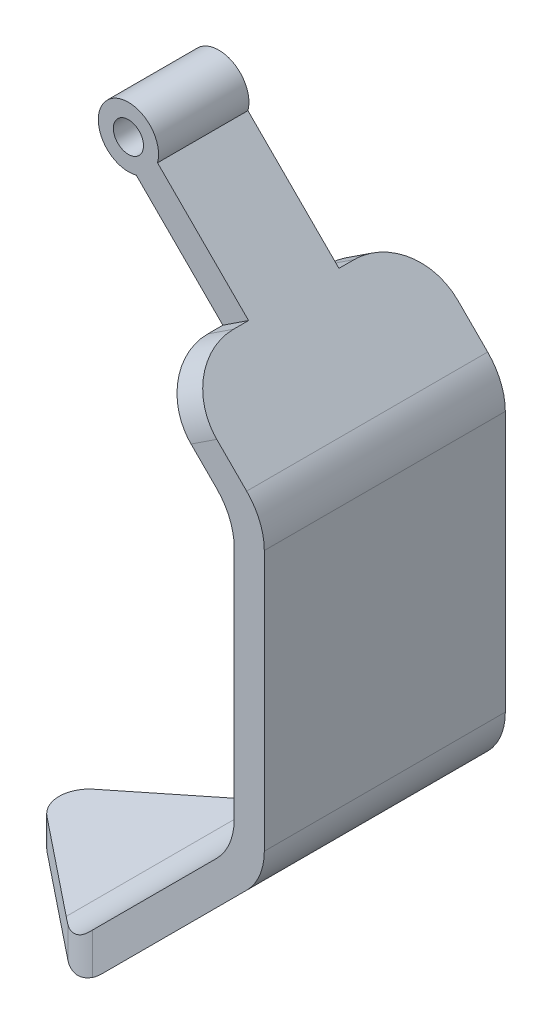
ISO-10303-21;
HEADER;
FILE_DESCRIPTION(('STEP AP214'),'2;1');
FILE_NAME('part.step','',(''),(''),'','','');
FILE_SCHEMA(('AUTOMOTIVE_DESIGN { 1 0 10303 214 1 1 1 1 }'));
ENDSEC;
DATA;
#1=APPLICATION_CONTEXT('core data for automotive mechanical design processes');
#2=APPLICATION_PROTOCOL_DEFINITION('international standard','automotive_design',2000,#1);
#3=PRODUCT_CONTEXT('',#1,'mechanical');
#4=PRODUCT('Part','Part','',(#3));
#5=PRODUCT_RELATED_PRODUCT_CATEGORY('part','',(#4));
#6=PRODUCT_DEFINITION_FORMATION('','',#4);
#7=PRODUCT_DEFINITION_CONTEXT('part definition',#1,'design');
#8=PRODUCT_DEFINITION('design','',#6,#7);
#9=PRODUCT_DEFINITION_SHAPE('','',#8);
#10=(LENGTH_UNIT() NAMED_UNIT(*) SI_UNIT(.MILLI.,.METRE.));
#11=(NAMED_UNIT(*) PLANE_ANGLE_UNIT() SI_UNIT($,.RADIAN.));
#12=(NAMED_UNIT(*) SI_UNIT($,.STERADIAN.) SOLID_ANGLE_UNIT());
#13=UNCERTAINTY_MEASURE_WITH_UNIT(LENGTH_MEASURE(1.E-05),#10,'distance_accuracy_value','');
#14=(GEOMETRIC_REPRESENTATION_CONTEXT(3) GLOBAL_UNCERTAINTY_ASSIGNED_CONTEXT((#13)) GLOBAL_UNIT_ASSIGNED_CONTEXT((#10,
#11,#12)) REPRESENTATION_CONTEXT('',''));
#15=CARTESIAN_POINT('',(0.,0.,0.));
#16=DIRECTION('',(0.,0.,1.));
#17=DIRECTION('',(1.,0.,0.));
#18=AXIS2_PLACEMENT_3D('',#15,#16,#17);
#19=CARTESIAN_POINT('',(0.,0.,-20.));
#20=DIRECTION('',(0.,0.,-1.));
#21=DIRECTION('',(1.,0.,0.));
#22=AXIS2_PLACEMENT_3D('',#19,#20,#21);
#23=PLANE('',#22);
#24=CARTESIAN_POINT('',(22.9289321881345,-50.,-20.));
#25=DIRECTION('',(0.,0.,-1.));
#26=DIRECTION('',(-1.,0.,0.));
#27=AXIS2_PLACEMENT_3D('',#24,#25,#26);
#28=CIRCLE('',#27,10.);
#29=CARTESIAN_POINT('',(30.,-57.0710678118655,-20.));
#30=VERTEX_POINT('',#29);
#31=CARTESIAN_POINT('',(28.5078105935821,-58.2991635564815,-20.));
#32=VERTEX_POINT('',#31);
#33=EDGE_CURVE('E272',#30,#32,#28,.T.);
#34=ORIENTED_EDGE('',*,*,#33,.T.);
#35=DIRECTION('',(0.,1.,0.));
#36=VECTOR('',#35,1.);
#37=CARTESIAN_POINT('',(28.5078105935821,0.,-20.));
#38=LINE('',#37,#36);
#39=CARTESIAN_POINT('',(28.5078105935821,-51.4921894064179,-20.));
#40=VERTEX_POINT('',#39);
#41=EDGE_CURVE('E322',#32,#40,#38,.T.);
#42=ORIENTED_EDGE('',*,*,#41,.T.);
#43=DIRECTION('',(0.707106781186546,0.707106781186549,0.));
#44=VECTOR('',#43,1.);
#45=CARTESIAN_POINT('',(40.0000000000001,-39.9999999999999,-20.));
#46=LINE('',#45,#44);
#47=CARTESIAN_POINT('',(49.1231060122937,-30.8768939877062,-20.));
#48=VERTEX_POINT('',#47);
#49=EDGE_CURVE('E487',#40,#48,#46,.T.);
#50=ORIENTED_EDGE('',*,*,#49,.T.);
#51=CARTESIAN_POINT('',(42.0520382004282,-23.8058261758407,-20.));
#52=DIRECTION('',(0.,0.,-1.));
#53=DIRECTION('',(-1.,0.,0.));
#54=AXIS2_PLACEMENT_3D('',#51,#52,#53);
#55=CIRCLE('',#54,10.);
#56=CARTESIAN_POINT('',(52.0520382004282,-23.8058261758407,-20.));
#57=VERTEX_POINT('',#56);
#58=EDGE_CURVE('E313',#48,#57,#55,.F.);
#59=ORIENTED_EDGE('',*,*,#58,.T.);
#60=DIRECTION('',(0.,-1.,0.));
#61=VECTOR('',#60,1.);
#62=CARTESIAN_POINT('',(52.0520382004282,0.,-20.));
#63=LINE('',#62,#61);
#64=CARTESIAN_POINT('',(52.0520382004282,15.270292269908,-20.));
#65=VERTEX_POINT('',#64);
#66=EDGE_CURVE('E481',#65,#57,#63,.T.);
#67=ORIENTED_EDGE('',*,*,#66,.F.);
#68=CARTESIAN_POINT('',(42.0520382004282,15.270292269908,-20.));
#69=DIRECTION('',(0.,0.,-1.));
#70=DIRECTION('',(-1.,0.,0.));
#71=AXIS2_PLACEMENT_3D('',#68,#69,#70);
#72=CIRCLE('',#71,10.);
#73=CARTESIAN_POINT('',(49.1231060122937,22.3413600817735,-20.));
#74=VERTEX_POINT('',#73);
#75=EDGE_CURVE('E318',#65,#74,#72,.F.);
#76=ORIENTED_EDGE('',*,*,#75,.T.);
#77=DIRECTION('',(0.707106781186546,-0.707106781186549,0.));
#78=VECTOR('',#77,1.);
#79=CARTESIAN_POINT('',(35.7322330470337,35.7322330470336,-20.));
#80=LINE('',#79,#78);
#81=CARTESIAN_POINT('',(44.8941927290895,26.5702733649777,-20.));
#82=VERTEX_POINT('',#81);
#83=EDGE_CURVE('E474',#82,#74,#80,.T.);
#84=ORIENTED_EDGE('',*,*,#83,.F.);
#85=DIRECTION('',(0.835816172223011,0.549009404519153,0.));
#86=VECTOR('',#85,1.);
#87=CARTESIAN_POINT('',(1.33929188295504,-2.03894834202568,-20.));
#88=LINE('',#87,#86);
#89=CARTESIAN_POINT('',(49.1619596820559,29.3735742238769,-20.));
#90=VERTEX_POINT('',#89);
#91=EDGE_CURVE('E240',#82,#90,#88,.T.);
#92=ORIENTED_EDGE('',*,*,#91,.T.);
#93=DIRECTION('',(0.707106781186548,-0.707106781186548,0.));
#94=VECTOR('',#93,1.);
#95=CARTESIAN_POINT('',(39.2677669529664,39.2677669529664,-20.));
#96=LINE('',#95,#94);
#97=CARTESIAN_POINT('',(54.1231060122937,24.4124278936391,-20.));
#98=VERTEX_POINT('',#97);
#99=EDGE_CURVE('E535',#90,#98,#96,.T.);
#100=ORIENTED_EDGE('',*,*,#99,.T.);
#101=CARTESIAN_POINT('',(47.0520382004282,17.3413600817736,-20.));
#102=DIRECTION('',(0.,0.,-1.));
#103=DIRECTION('',(-1.,0.,0.));
#104=AXIS2_PLACEMENT_3D('',#101,#102,#103);
#105=CIRCLE('',#104,10.);
#106=CARTESIAN_POINT('',(57.0520382004282,17.3413600817736,-20.));
#107=VERTEX_POINT('',#106);
#108=EDGE_CURVE('E268',#98,#107,#105,.T.);
#109=ORIENTED_EDGE('',*,*,#108,.T.);
#110=DIRECTION('',(0.,-1.,0.));
#111=VECTOR('',#110,1.);
#112=CARTESIAN_POINT('',(57.0520382004282,0.,-20.));
#113=LINE('',#112,#111);
#114=CARTESIAN_POINT('',(57.0520382004282,-25.8768939877063,-20.));
#115=VERTEX_POINT('',#114);
#116=EDGE_CURVE('E531',#107,#115,#113,.T.);
#117=ORIENTED_EDGE('',*,*,#116,.T.);
#118=CARTESIAN_POINT('',(47.0520382004282,-25.8768939877063,-20.));
#119=DIRECTION('',(0.,0.,-1.));
#120=DIRECTION('',(-1.,0.,0.));
#121=AXIS2_PLACEMENT_3D('',#118,#119,#120);
#122=CIRCLE('',#121,10.);
#123=CARTESIAN_POINT('',(54.1231060122937,-32.9479617995718,-20.));
#124=VERTEX_POINT('',#123);
#125=EDGE_CURVE('E270',#115,#124,#122,.T.);
#126=ORIENTED_EDGE('',*,*,#125,.T.);
#127=DIRECTION('',(0.707106781186548,0.707106781186548,0.));
#128=VECTOR('',#127,1.);
#129=CARTESIAN_POINT('',(43.5355339059327,-43.5355339059327,-20.));
#130=LINE('',#129,#128);
#131=EDGE_CURVE('E530',#30,#124,#130,.T.);
#132=ORIENTED_EDGE('',*,*,#131,.F.);
#133=EDGE_LOOP('',(#34,#42,#50,#59,#67,#76,#84,#92,#100,#109,#117,#126,#132));
#134=FACE_BOUND('',#133,.T.);
#135=ADVANCED_FACE('F38',(#134),#23,.T.);
#136=CARTESIAN_POINT('',(0.,-55.,20.));
#137=DIRECTION('',(0.,1.,0.));
#138=DIRECTION('',(0.,0.,1.));
#139=AXIS2_PLACEMENT_3D('',#136,#137,#138);
#140=PLANE('',#139);
#141=DIRECTION('',(-0.780868809443031,0.,0.624695047554424));
#142=VECTOR('',#141,1.);
#143=CARTESIAN_POINT('',(25.,-55.,-20.));
#144=LINE('',#143,#142);
#145=CARTESIAN_POINT('',(20.857864376269,-55.,-16.6862915010152));
#146=VERTEX_POINT('',#145);
#147=CARTESIAN_POINT('',(4.88043005901893,-55.,-3.90434404721515));
#148=VERTEX_POINT('',#147);
#149=EDGE_CURVE('E546',#146,#148,#144,.T.);
#150=ORIENTED_EDGE('',*,*,#149,.T.);
#151=CARTESIAN_POINT('',(8.00390529679106,-55.,0.));
#152=DIRECTION('',(0.,1.,0.));
#153=DIRECTION('',(0.,0.,1.));
#154=AXIS2_PLACEMENT_3D('',#151,#152,#153);
#155=CIRCLE('',#154,5.);
#156=CARTESIAN_POINT('',(4.88043005901893,-55.,3.90434404721515));
#157=VERTEX_POINT('',#156);
#158=EDGE_CURVE('E11',#148,#157,#155,.T.);
#159=ORIENTED_EDGE('',*,*,#158,.T.);
#160=DIRECTION('',(-0.780868809443031,0.,-0.624695047554424));
#161=VECTOR('',#160,1.);
#162=CARTESIAN_POINT('',(25.,-55.,20.));
#163=LINE('',#162,#161);
#164=CARTESIAN_POINT('',(20.857864376269,-55.,16.6862915010152));
#165=VERTEX_POINT('',#164);
#166=EDGE_CURVE('E480',#165,#157,#163,.T.);
#167=ORIENTED_EDGE('',*,*,#166,.F.);
#168=DIRECTION('',(0.,0.,-1.));
#169=VECTOR('',#168,1.);
#170=CARTESIAN_POINT('',(20.857864376269,-55.,-20.));
#171=LINE('',#170,#169);
#172=EDGE_CURVE('E292',#165,#146,#171,.T.);
#173=ORIENTED_EDGE('',*,*,#172,.T.);
#174=EDGE_LOOP('',(#150,#159,#167,#173));
#175=FACE_BOUND('',#174,.T.);
#176=ADVANCED_FACE('F400',(#175),#140,.T.);
#177=CARTESIAN_POINT('',(0.,-60.,20.));
#178=DIRECTION('',(0.,1.,0.));
#179=DIRECTION('',(0.,0.,1.));
#180=AXIS2_PLACEMENT_3D('',#177,#178,#179);
#181=PLANE('',#180);
#182=DIRECTION('',(0.780868809443031,0.,0.624695047554424));
#183=VECTOR('',#182,1.);
#184=CARTESIAN_POINT('',(25.,-60.,20.));
#185=LINE('',#184,#183);
#186=CARTESIAN_POINT('',(4.88043005901893,-60.,3.90434404721515));
#187=VERTEX_POINT('',#186);
#188=CARTESIAN_POINT('',(22.2608601180379,-60.,17.8086880944303));
#189=VERTEX_POINT('',#188);
#190=EDGE_CURVE('E484',#187,#189,#185,.T.);
#191=ORIENTED_EDGE('',*,*,#190,.F.);
#192=CARTESIAN_POINT('',(8.00390529679106,-60.,0.));
#193=DIRECTION('',(0.,1.,0.));
#194=DIRECTION('',(0.,0.,1.));
#195=AXIS2_PLACEMENT_3D('',#192,#193,#194);
#196=CIRCLE('',#195,5.);
#197=CARTESIAN_POINT('',(4.88043005901893,-60.,-3.90434404721515));
#198=VERTEX_POINT('',#197);
#199=EDGE_CURVE('E60',#187,#198,#196,.F.);
#200=ORIENTED_EDGE('',*,*,#199,.T.);
#201=DIRECTION('',(0.780868809443031,0.,-0.624695047554424));
#202=VECTOR('',#201,1.);
#203=CARTESIAN_POINT('',(25.,-60.,-20.));
#204=LINE('',#203,#202);
#205=CARTESIAN_POINT('',(22.2608601180379,-60.,-17.8086880944303));
#206=VERTEX_POINT('',#205);
#207=EDGE_CURVE('E545',#198,#206,#204,.T.);
#208=ORIENTED_EDGE('',*,*,#207,.T.);
#209=CARTESIAN_POINT('',(28.5078105935821,-60.,-10.));
#210=DIRECTION('',(0.,1.,0.));
#211=DIRECTION('',(0.,0.,1.));
#212=AXIS2_PLACEMENT_3D('',#209,#210,#211);
#213=CIRCLE('',#212,10.);
#214=CARTESIAN_POINT('',(22.9289321881345,-60.,-18.2991635564815));
#215=VERTEX_POINT('',#214);
#216=EDGE_CURVE('E550',#206,#215,#213,.F.);
#217=ORIENTED_EDGE('',*,*,#216,.T.);
#218=DIRECTION('',(0.,0.,-1.));
#219=VECTOR('',#218,1.);
#220=CARTESIAN_POINT('',(22.9289321881345,-60.,20.));
#221=LINE('',#220,#219);
#222=CARTESIAN_POINT('',(22.9289321881345,-60.,18.2991635564815));
#223=VERTEX_POINT('',#222);
#224=EDGE_CURVE('E275',#215,#223,#221,.F.);
#225=ORIENTED_EDGE('',*,*,#224,.T.);
#226=CARTESIAN_POINT('',(28.5078105935821,-60.,10.));
#227=DIRECTION('',(0.,1.,0.));
#228=DIRECTION('',(0.,0.,1.));
#229=AXIS2_PLACEMENT_3D('',#226,#227,#228);
#230=CIRCLE('',#229,10.);
#231=EDGE_CURVE('E555',#223,#189,#230,.F.);
#232=ORIENTED_EDGE('',*,*,#231,.T.);
#233=EDGE_LOOP('',(#191,#200,#208,#217,#225,#232));
#234=FACE_BOUND('',#233,.T.);
#235=ADVANCED_FACE('F406',(#234),#181,.F.);
#236=CARTESIAN_POINT('',(22.,53.,20.));
#237=DIRECTION('',(0.,0.,-1.));
#238=DIRECTION('',(-1.,0.,0.));
#239=AXIS2_PLACEMENT_3D('',#236,#237,#238);
#240=CYLINDRICAL_SURFACE('',#239,5.);
#241=CARTESIAN_POINT('',(22.,53.,-7.5));
#242=DIRECTION('',(0.,0.,1.));
#243=DIRECTION('',(1.,0.,0.));
#244=AXIS2_PLACEMENT_3D('',#241,#242,#243);
#245=CIRCLE('',#244,5.);
#246=CARTESIAN_POINT('',(26.8296291314453,51.7059047744874,-7.5));
#247=VERTEX_POINT('',#246);
#248=CARTESIAN_POINT('',(23.2940952255126,48.1703708685547,-7.5));
#249=VERTEX_POINT('',#248);
#250=EDGE_CURVE('E210',#247,#249,#245,.T.);
#251=ORIENTED_EDGE('',*,*,#250,.T.);
#252=DIRECTION('',(0.,0.,-1.));
#253=VECTOR('',#252,1.);
#254=CARTESIAN_POINT('',(23.2940952255126,48.1703708685547,20.));
#255=LINE('',#254,#253);
#256=CARTESIAN_POINT('',(23.2940952255126,48.1703708685547,7.5));
#257=VERTEX_POINT('',#256);
#258=EDGE_CURVE('E237',#257,#249,#255,.T.);
#259=ORIENTED_EDGE('',*,*,#258,.F.);
#260=CARTESIAN_POINT('',(22.,53.,7.5));
#261=DIRECTION('',(0.,0.,1.));
#262=DIRECTION('',(1.,0.,0.));
#263=AXIS2_PLACEMENT_3D('',#260,#261,#262);
#264=CIRCLE('',#263,5.);
#265=CARTESIAN_POINT('',(26.8296291314453,51.7059047744874,7.5));
#266=VERTEX_POINT('',#265);
#267=EDGE_CURVE('E236',#266,#257,#264,.T.);
#268=ORIENTED_EDGE('',*,*,#267,.F.);
#269=DIRECTION('',(0.,0.,-1.));
#270=VECTOR('',#269,1.);
#271=CARTESIAN_POINT('',(26.8296291314453,51.7059047744874,20.));
#272=LINE('',#271,#270);
#273=EDGE_CURVE('E229',#266,#247,#272,.T.);
#274=ORIENTED_EDGE('',*,*,#273,.T.);
#275=EDGE_LOOP('',(#251,#259,#268,#274));
#276=FACE_BOUND('',#275,.T.);
#277=ADVANCED_FACE('F235',(#276),#240,.T.);
#278=CARTESIAN_POINT('',(22.,53.,20.));
#279=DIRECTION('',(0.,0.,-1.));
#280=DIRECTION('',(-1.,0.,0.));
#281=AXIS2_PLACEMENT_3D('',#278,#279,#280);
#282=CYLINDRICAL_SURFACE('',#281,2.5);
#283=CARTESIAN_POINT('',(22.,53.,7.5));
#284=DIRECTION('',(0.,0.,1.));
#285=DIRECTION('',(1.,0.,0.));
#286=AXIS2_PLACEMENT_3D('',#283,#284,#285);
#287=CIRCLE('',#286,2.5);
#288=CARTESIAN_POINT('',(24.5,53.,7.5));
#289=VERTEX_POINT('',#288);
#290=EDGE_CURVE('E492',#289,#289,#287,.F.);
#291=ORIENTED_EDGE('',*,*,#290,.F.);
#292=EDGE_LOOP('',(#291));
#293=FACE_BOUND('',#292,.T.);
#294=CARTESIAN_POINT('',(22.,53.,-7.5));
#295=DIRECTION('',(0.,0.,1.));
#296=DIRECTION('',(1.,0.,0.));
#297=AXIS2_PLACEMENT_3D('',#294,#295,#296);
#298=CIRCLE('',#297,2.5);
#299=CARTESIAN_POINT('',(24.5,53.,-7.5));
#300=VERTEX_POINT('',#299);
#301=EDGE_CURVE('E222',#300,#300,#298,.F.);
#302=ORIENTED_EDGE('',*,*,#301,.T.);
#303=EDGE_LOOP('',(#302));
#304=FACE_BOUND('',#303,.T.);
#305=ADVANCED_FACE('F430',(#293,#304),#282,.F.);
#306=CARTESIAN_POINT('',(35.7322330470337,35.7322330470336,20.));
#307=DIRECTION('',(0.707106781186549,0.707106781186546,0.));
#308=DIRECTION('',(-0.707106781186546,0.707106781186549,0.));
#309=AXIS2_PLACEMENT_3D('',#306,#307,#308);
#310=PLANE('',#309);
#311=ORIENTED_EDGE('',*,*,#83,.T.);
#312=DIRECTION('',(0.,0.,-1.));
#313=VECTOR('',#312,1.);
#314=CARTESIAN_POINT('',(49.1231060122937,22.3413600817735,20.));
#315=LINE('',#314,#313);
#316=CARTESIAN_POINT('',(49.1231060122937,22.3413600817735,20.));
#317=VERTEX_POINT('',#316);
#318=EDGE_CURVE('E306',#74,#317,#315,.F.);
#319=ORIENTED_EDGE('',*,*,#318,.T.);
#320=DIRECTION('',(0.707106781186546,-0.707106781186549,0.));
#321=VECTOR('',#320,1.);
#322=CARTESIAN_POINT('',(35.7322330470337,35.7322330470336,20.));
#323=LINE('',#322,#321);
#324=CARTESIAN_POINT('',(44.8941927290895,26.5702733649777,20.));
#325=VERTEX_POINT('',#324);
#326=EDGE_CURVE('E508',#325,#317,#323,.T.);
#327=ORIENTED_EDGE('',*,*,#326,.F.);
#328=CARTESIAN_POINT('',(44.8941927290895,26.5702733649777,10.));
#329=DIRECTION('',(0.707106781186549,0.707106781186546,0.));
#330=DIRECTION('',(-0.707106781186546,0.707106781186549,0.));
#331=AXIS2_PLACEMENT_3D('',#328,#329,#330);
#332=ELLIPSE('',#331,10.2122143476009,10.);
#333=CARTESIAN_POINT('',(37.6730667129704,33.7913993810968,10.));
#334=VERTEX_POINT('',#333);
#335=EDGE_CURVE('E254',#325,#334,#332,.F.);
#336=ORIENTED_EDGE('',*,*,#335,.T.);
#337=DIRECTION('',(0.,0.,1.));
#338=VECTOR('',#337,1.);
#339=CARTESIAN_POINT('',(37.6730667129704,33.7913993810968,7.5));
#340=LINE('',#339,#338);
#341=CARTESIAN_POINT('',(37.6730667129704,33.7913993810968,7.5));
#342=VERTEX_POINT('',#341);
#343=EDGE_CURVE('E504',#342,#334,#340,.T.);
#344=ORIENTED_EDGE('',*,*,#343,.F.);
#345=DIRECTION('',(0.707106781186546,-0.707106781186549,0.));
#346=VECTOR('',#345,1.);
#347=CARTESIAN_POINT('',(35.7322330470337,35.7322330470336,7.5));
#348=LINE('',#347,#346);
#349=EDGE_CURVE('E496',#257,#342,#348,.T.);
#350=ORIENTED_EDGE('',*,*,#349,.F.);
#351=ORIENTED_EDGE('',*,*,#258,.T.);
#352=DIRECTION('',(0.707106781186546,-0.707106781186549,0.));
#353=VECTOR('',#352,1.);
#354=CARTESIAN_POINT('',(35.7322330470337,35.7322330470336,-7.5));
#355=LINE('',#354,#353);
#356=CARTESIAN_POINT('',(37.6730667129704,33.7913993810968,-7.5));
#357=VERTEX_POINT('',#356);
#358=EDGE_CURVE('E217',#249,#357,#355,.T.);
#359=ORIENTED_EDGE('',*,*,#358,.T.);
#360=DIRECTION('',(0.,0.,-1.));
#361=VECTOR('',#360,1.);
#362=CARTESIAN_POINT('',(37.6730667129704,33.7913993810968,-7.5));
#363=LINE('',#362,#361);
#364=CARTESIAN_POINT('',(37.6730667129704,33.7913993810968,-10.));
#365=VERTEX_POINT('',#364);
#366=EDGE_CURVE('E476',#357,#365,#363,.T.);
#367=ORIENTED_EDGE('',*,*,#366,.T.);
#368=CARTESIAN_POINT('',(44.8941927290895,26.5702733649777,-10.));
#369=DIRECTION('',(0.707106781186549,0.707106781186546,0.));
#370=DIRECTION('',(0.707106781186546,-0.707106781186549,0.));
#371=AXIS2_PLACEMENT_3D('',#368,#369,#370);
#372=ELLIPSE('',#371,10.2122143476009,10.);
#373=EDGE_CURVE('E256',#365,#82,#372,.F.);
#374=ORIENTED_EDGE('',*,*,#373,.T.);
#375=EDGE_LOOP('',(#311,#319,#327,#336,#344,#350,#351,#359,#367,#374));
#376=FACE_BOUND('',#375,.T.);
#377=ADVANCED_FACE('F433',(#376),#310,.F.);
#378=CARTESIAN_POINT('',(39.2677669529664,39.2677669529664,20.));
#379=DIRECTION('',(0.707106781186548,0.707106781186548,0.));
#380=DIRECTION('',(-0.707106781186548,0.707106781186548,0.));
#381=AXIS2_PLACEMENT_3D('',#378,#379,#380);
#382=PLANE('',#381);
#383=DIRECTION('',(0.707106781186548,-0.707106781186548,0.));
#384=VECTOR('',#383,1.);
#385=CARTESIAN_POINT('',(39.2677669529664,39.2677669529664,20.));
#386=LINE('',#385,#384);
#387=CARTESIAN_POINT('',(49.1619596820559,29.3735742238769,20.));
#388=VERTEX_POINT('',#387);
#389=CARTESIAN_POINT('',(54.1231060122937,24.4124278936391,20.));
#390=VERTEX_POINT('',#389);
#391=EDGE_CURVE('E238',#388,#390,#386,.T.);
#392=ORIENTED_EDGE('',*,*,#391,.T.);
#393=DIRECTION('',(0.,0.,-1.));
#394=VECTOR('',#393,1.);
#395=CARTESIAN_POINT('',(54.1231060122937,24.4124278936391,20.));
#396=LINE('',#395,#394);
#397=EDGE_CURVE('E289',#390,#98,#396,.T.);
#398=ORIENTED_EDGE('',*,*,#397,.T.);
#399=ORIENTED_EDGE('',*,*,#99,.F.);
#400=CARTESIAN_POINT('',(49.1619596820559,29.3735742238769,-10.));
#401=DIRECTION('',(0.707106781186548,0.707106781186548,0.));
#402=DIRECTION('',(0.707106781186548,-0.707106781186548,0.));
#403=AXIS2_PLACEMENT_3D('',#400,#401,#402);
#404=ELLIPSE('',#403,10.2122143476009,10.);
#405=CARTESIAN_POINT('',(41.9408336659368,36.594700239996,-10.));
#406=VERTEX_POINT('',#405);
#407=EDGE_CURVE('E250',#90,#406,#404,.T.);
#408=ORIENTED_EDGE('',*,*,#407,.T.);
#409=DIRECTION('',(0.,0.,-1.));
#410=VECTOR('',#409,1.);
#411=CARTESIAN_POINT('',(41.9408336659368,36.594700239996,-7.5));
#412=LINE('',#411,#410);
#413=CARTESIAN_POINT('',(41.9408336659368,36.594700239996,-7.5));
#414=VERTEX_POINT('',#413);
#415=EDGE_CURVE('E231',#414,#406,#412,.T.);
#416=ORIENTED_EDGE('',*,*,#415,.F.);
#417=DIRECTION('',(-0.707106781186548,0.707106781186548,0.));
#418=VECTOR('',#417,1.);
#419=CARTESIAN_POINT('',(39.2677669529664,39.2677669529664,-7.5));
#420=LINE('',#419,#418);
#421=EDGE_CURVE('E214',#414,#247,#420,.T.);
#422=ORIENTED_EDGE('',*,*,#421,.T.);
#423=ORIENTED_EDGE('',*,*,#273,.F.);
#424=DIRECTION('',(-0.707106781186548,0.707106781186548,0.));
#425=VECTOR('',#424,1.);
#426=CARTESIAN_POINT('',(39.2677669529664,39.2677669529664,7.5));
#427=LINE('',#426,#425);
#428=CARTESIAN_POINT('',(41.9408336659368,36.594700239996,7.5));
#429=VERTEX_POINT('',#428);
#430=EDGE_CURVE('E502',#429,#266,#427,.T.);
#431=ORIENTED_EDGE('',*,*,#430,.F.);
#432=DIRECTION('',(0.,0.,1.));
#433=VECTOR('',#432,1.);
#434=CARTESIAN_POINT('',(41.9408336659368,36.594700239996,7.5));
#435=LINE('',#434,#433);
#436=CARTESIAN_POINT('',(41.9408336659368,36.594700239996,10.));
#437=VERTEX_POINT('',#436);
#438=EDGE_CURVE('E505',#429,#437,#435,.T.);
#439=ORIENTED_EDGE('',*,*,#438,.T.);
#440=CARTESIAN_POINT('',(49.1619596820559,29.3735742238769,10.));
#441=DIRECTION('',(0.707106781186548,0.707106781186548,0.));
#442=DIRECTION('',(-0.707106781186548,0.707106781186548,0.));
#443=AXIS2_PLACEMENT_3D('',#440,#441,#442);
#444=ELLIPSE('',#443,10.2122143476009,10.);
#445=EDGE_CURVE('E248',#437,#388,#444,.T.);
#446=ORIENTED_EDGE('',*,*,#445,.T.);
#447=EDGE_LOOP('',(#392,#398,#399,#408,#416,#422,#423,#431,#439,#446));
#448=FACE_BOUND('',#447,.T.);
#449=ADVANCED_FACE('F227',(#448),#382,.T.);
#450=CARTESIAN_POINT('',(52.0520382004282,0.,20.));
#451=DIRECTION('',(1.,0.,0.));
#452=DIRECTION('',(0.,1.,0.));
#453=AXIS2_PLACEMENT_3D('',#450,#451,#452);
#454=PLANE('',#453);
#455=ORIENTED_EDGE('',*,*,#66,.T.);
#456=DIRECTION('',(0.,0.,-1.));
#457=VECTOR('',#456,1.);
#458=CARTESIAN_POINT('',(52.0520382004282,-23.8058261758407,20.));
#459=LINE('',#458,#457);
#460=CARTESIAN_POINT('',(52.0520382004282,-23.8058261758407,20.));
#461=VERTEX_POINT('',#460);
#462=EDGE_CURVE('E304',#57,#461,#459,.F.);
#463=ORIENTED_EDGE('',*,*,#462,.T.);
#464=DIRECTION('',(0.,-1.,0.));
#465=VECTOR('',#464,1.);
#466=CARTESIAN_POINT('',(52.0520382004282,0.,20.));
#467=LINE('',#466,#465);
#468=CARTESIAN_POINT('',(52.0520382004282,15.270292269908,20.));
#469=VERTEX_POINT('',#468);
#470=EDGE_CURVE('E513',#469,#461,#467,.T.);
#471=ORIENTED_EDGE('',*,*,#470,.F.);
#472=DIRECTION('',(0.,0.,-1.));
#473=VECTOR('',#472,1.);
#474=CARTESIAN_POINT('',(52.0520382004282,15.270292269908,-20.));
#475=LINE('',#474,#473);
#476=EDGE_CURVE('E301',#469,#65,#475,.T.);
#477=ORIENTED_EDGE('',*,*,#476,.T.);
#478=EDGE_LOOP('',(#455,#463,#471,#477));
#479=FACE_BOUND('',#478,.T.);
#480=ADVANCED_FACE('F437',(#479),#454,.F.);
#481=CARTESIAN_POINT('',(40.0000000000001,-39.9999999999999,20.));
#482=DIRECTION('',(-0.707106781186549,0.707106781186546,0.));
#483=DIRECTION('',(-0.707106781186546,-0.707106781186549,0.));
#484=AXIS2_PLACEMENT_3D('',#481,#482,#483);
#485=PLANE('',#484);
#486=ORIENTED_EDGE('',*,*,#49,.F.);
#487=CARTESIAN_POINT('',(28.5078105935821,-51.4921894064179,-10.));
#488=DIRECTION('',(-0.707106781186549,0.707106781186546,0.));
#489=DIRECTION('',(0.707106781186546,0.707106781186549,0.));
#490=AXIS2_PLACEMENT_3D('',#487,#488,#489);
#491=ELLIPSE('',#490,14.142135623731,10.);
#492=CARTESIAN_POINT('',(27.9289321881345,-52.0710678118655,-19.9832309294991));
#493=VERTEX_POINT('',#492);
#494=EDGE_CURVE('E327',#40,#493,#491,.T.);
#495=ORIENTED_EDGE('',*,*,#494,.T.);
#496=DIRECTION('',(0.,0.,-1.));
#497=VECTOR('',#496,1.);
#498=CARTESIAN_POINT('',(27.9289321881345,-52.0710678118655,20.));
#499=LINE('',#498,#497);
#500=CARTESIAN_POINT('',(27.9289321881345,-52.0710678118655,19.983230929499));
#501=VERTEX_POINT('',#500);
#502=EDGE_CURVE('E298',#493,#501,#499,.F.);
#503=ORIENTED_EDGE('',*,*,#502,.T.);
#504=CARTESIAN_POINT('',(28.5078105935821,-51.4921894064179,10.));
#505=DIRECTION('',(-0.707106781186549,0.707106781186546,0.));
#506=DIRECTION('',(-0.707106781186546,-0.707106781186549,0.));
#507=AXIS2_PLACEMENT_3D('',#504,#505,#506);
#508=ELLIPSE('',#507,14.142135623731,10.);
#509=CARTESIAN_POINT('',(28.5078105935821,-51.4921894064179,20.));
#510=VERTEX_POINT('',#509);
#511=EDGE_CURVE('E325',#501,#510,#508,.T.);
#512=ORIENTED_EDGE('',*,*,#511,.T.);
#513=DIRECTION('',(0.707106781186546,0.707106781186549,0.));
#514=VECTOR('',#513,1.);
#515=CARTESIAN_POINT('',(40.0000000000001,-39.9999999999999,20.));
#516=LINE('',#515,#514);
#517=CARTESIAN_POINT('',(49.1231060122937,-30.8768939877062,20.));
#518=VERTEX_POINT('',#517);
#519=EDGE_CURVE('E516',#510,#518,#516,.T.);
#520=ORIENTED_EDGE('',*,*,#519,.T.);
#521=DIRECTION('',(0.,0.,-1.));
#522=VECTOR('',#521,1.);
#523=CARTESIAN_POINT('',(49.1231060122937,-30.8768939877062,20.));
#524=LINE('',#523,#522);
#525=EDGE_CURVE('E295',#518,#48,#524,.T.);
#526=ORIENTED_EDGE('',*,*,#525,.T.);
#527=EDGE_LOOP('',(#486,#495,#503,#512,#520,#526));
#528=FACE_BOUND('',#527,.T.);
#529=ADVANCED_FACE('F444',(#528),#485,.T.);
#530=CARTESIAN_POINT('',(43.5355339059327,-43.5355339059327,20.));
#531=DIRECTION('',(-0.707106781186548,0.707106781186548,0.));
#532=DIRECTION('',(-0.707106781186548,-0.707106781186548,0.));
#533=AXIS2_PLACEMENT_3D('',#530,#531,#532);
#534=PLANE('',#533);
#535=DIRECTION('',(0.707106781186548,0.707106781186548,0.));
#536=VECTOR('',#535,1.);
#537=CARTESIAN_POINT('',(43.5355339059327,-43.5355339059327,20.));
#538=LINE('',#537,#536);
#539=CARTESIAN_POINT('',(30.,-57.0710678118655,20.));
#540=VERTEX_POINT('',#539);
#541=CARTESIAN_POINT('',(54.1231060122937,-32.9479617995718,20.));
#542=VERTEX_POINT('',#541);
#543=EDGE_CURVE('E518',#540,#542,#538,.T.);
#544=ORIENTED_EDGE('',*,*,#543,.F.);
#545=DIRECTION('',(0.,0.,-1.));
#546=VECTOR('',#545,1.);
#547=CARTESIAN_POINT('',(30.,-57.0710678118655,20.));
#548=LINE('',#547,#546);
#549=EDGE_CURVE('E265',#540,#30,#548,.T.);
#550=ORIENTED_EDGE('',*,*,#549,.T.);
#551=ORIENTED_EDGE('',*,*,#131,.T.);
#552=DIRECTION('',(0.,0.,-1.));
#553=VECTOR('',#552,1.);
#554=CARTESIAN_POINT('',(54.1231060122937,-32.9479617995718,20.));
#555=LINE('',#554,#553);
#556=EDGE_CURVE('E263',#124,#542,#555,.F.);
#557=ORIENTED_EDGE('',*,*,#556,.T.);
#558=EDGE_LOOP('',(#544,#550,#551,#557));
#559=FACE_BOUND('',#558,.T.);
#560=ADVANCED_FACE('F440',(#559),#534,.F.);
#561=CARTESIAN_POINT('',(57.0520382004282,0.,20.));
#562=DIRECTION('',(1.,0.,0.));
#563=DIRECTION('',(0.,0.,-1.));
#564=AXIS2_PLACEMENT_3D('',#561,#562,#563);
#565=PLANE('',#564);
#566=DIRECTION('',(0.,-1.,0.));
#567=VECTOR('',#566,1.);
#568=CARTESIAN_POINT('',(57.0520382004282,0.,20.));
#569=LINE('',#568,#567);
#570=CARTESIAN_POINT('',(57.0520382004282,17.3413600817736,20.));
#571=VERTEX_POINT('',#570);
#572=CARTESIAN_POINT('',(57.0520382004282,-25.8768939877063,20.));
#573=VERTEX_POINT('',#572);
#574=EDGE_CURVE('E242',#571,#573,#569,.T.);
#575=ORIENTED_EDGE('',*,*,#574,.T.);
#576=DIRECTION('',(0.,0.,-1.));
#577=VECTOR('',#576,1.);
#578=CARTESIAN_POINT('',(57.0520382004282,-25.8768939877063,-20.));
#579=LINE('',#578,#577);
#580=EDGE_CURVE('E286',#573,#115,#579,.T.);
#581=ORIENTED_EDGE('',*,*,#580,.T.);
#582=ORIENTED_EDGE('',*,*,#116,.F.);
#583=DIRECTION('',(0.,0.,-1.));
#584=VECTOR('',#583,1.);
#585=CARTESIAN_POINT('',(57.0520382004282,17.3413600817736,20.));
#586=LINE('',#585,#584);
#587=EDGE_CURVE('E284',#107,#571,#586,.F.);
#588=ORIENTED_EDGE('',*,*,#587,.T.);
#589=EDGE_LOOP('',(#575,#581,#582,#588));
#590=FACE_BOUND('',#589,.T.);
#591=ADVANCED_FACE('F428',(#590),#565,.T.);
#592=CARTESIAN_POINT('',(0.,0.,20.));
#593=DIRECTION('',(0.,0.,1.));
#594=DIRECTION('',(1.,0.,0.));
#595=AXIS2_PLACEMENT_3D('',#592,#593,#594);
#596=PLANE('',#595);
#597=ORIENTED_EDGE('',*,*,#519,.F.);
#598=DIRECTION('',(0.,1.,0.));
#599=VECTOR('',#598,1.);
#600=CARTESIAN_POINT('',(28.5078105935821,-59.7831834347852,20.));
#601=LINE('',#600,#599);
#602=CARTESIAN_POINT('',(28.5078105935821,-58.2991635564815,20.));
#603=VERTEX_POINT('',#602);
#604=EDGE_CURVE('E567',#510,#603,#601,.F.);
#605=ORIENTED_EDGE('',*,*,#604,.T.);
#606=CARTESIAN_POINT('',(22.9289321881345,-50.,20.));
#607=DIRECTION('',(0.,0.,1.));
#608=DIRECTION('',(1.,0.,0.));
#609=AXIS2_PLACEMENT_3D('',#606,#607,#608);
#610=CIRCLE('',#609,10.);
#611=EDGE_CURVE('E282',#603,#540,#610,.T.);
#612=ORIENTED_EDGE('',*,*,#611,.T.);
#613=ORIENTED_EDGE('',*,*,#543,.T.);
#614=CARTESIAN_POINT('',(47.0520382004282,-25.8768939877063,20.));
#615=DIRECTION('',(0.,0.,1.));
#616=DIRECTION('',(1.,0.,0.));
#617=AXIS2_PLACEMENT_3D('',#614,#615,#616);
#618=CIRCLE('',#617,10.);
#619=EDGE_CURVE('E280',#542,#573,#618,.T.);
#620=ORIENTED_EDGE('',*,*,#619,.T.);
#621=ORIENTED_EDGE('',*,*,#574,.F.);
#622=CARTESIAN_POINT('',(47.0520382004282,17.3413600817736,20.));
#623=DIRECTION('',(0.,0.,1.));
#624=DIRECTION('',(1.,0.,0.));
#625=AXIS2_PLACEMENT_3D('',#622,#623,#624);
#626=CIRCLE('',#625,10.);
#627=EDGE_CURVE('E278',#571,#390,#626,.T.);
#628=ORIENTED_EDGE('',*,*,#627,.T.);
#629=ORIENTED_EDGE('',*,*,#391,.F.);
#630=DIRECTION('',(0.835816172223011,0.549009404519153,0.));
#631=VECTOR('',#630,1.);
#632=CARTESIAN_POINT('',(43.1631607581619,25.4332376588667,20.));
#633=LINE('',#632,#631);
#634=EDGE_CURVE('E261',#388,#325,#633,.F.);
#635=ORIENTED_EDGE('',*,*,#634,.T.);
#636=ORIENTED_EDGE('',*,*,#326,.T.);
#637=CARTESIAN_POINT('',(42.0520382004282,15.270292269908,20.));
#638=DIRECTION('',(0.,0.,1.));
#639=DIRECTION('',(1.,0.,0.));
#640=AXIS2_PLACEMENT_3D('',#637,#638,#639);
#641=CIRCLE('',#640,10.);
#642=EDGE_CURVE('E320',#317,#469,#641,.F.);
#643=ORIENTED_EDGE('',*,*,#642,.T.);
#644=ORIENTED_EDGE('',*,*,#470,.T.);
#645=CARTESIAN_POINT('',(42.0520382004282,-23.8058261758407,20.));
#646=DIRECTION('',(0.,0.,1.));
#647=DIRECTION('',(1.,0.,0.));
#648=AXIS2_PLACEMENT_3D('',#645,#646,#647);
#649=CIRCLE('',#648,10.);
#650=EDGE_CURVE('E315',#461,#518,#649,.F.);
#651=ORIENTED_EDGE('',*,*,#650,.T.);
#652=EDGE_LOOP('',(#597,#605,#612,#613,#620,#621,#628,#629,#635,#636,#643,#644,#651));
#653=FACE_BOUND('',#652,.T.);
#654=ADVANCED_FACE('F424',(#653),#596,.T.);
#655=CARTESIAN_POINT('',(-4.15080216223648,6.31921338020442,7.5));
#656=DIRECTION('',(0.549009404519152,-0.835816172223011,0.));
#657=DIRECTION('',(0.835816172223011,0.549009404519153,0.));
#658=AXIS2_PLACEMENT_3D('',#655,#656,#657);
#659=PLANE('',#658);
#660=ORIENTED_EDGE('',*,*,#343,.T.);
#661=DIRECTION('',(0.835816172223011,0.549009404519153,0.));
#662=VECTOR('',#661,1.);
#663=CARTESIAN_POINT('',(41.9408336659368,36.594700239996,10.));
#664=LINE('',#663,#662);
#665=EDGE_CURVE('E258',#334,#437,#664,.T.);
#666=ORIENTED_EDGE('',*,*,#665,.T.);
#667=ORIENTED_EDGE('',*,*,#438,.F.);
#668=DIRECTION('',(0.835816172223011,0.549009404519153,0.));
#669=VECTOR('',#668,1.);
#670=CARTESIAN_POINT('',(-4.15080216223648,6.31921338020442,7.5));
#671=LINE('',#670,#669);
#672=EDGE_CURVE('E499',#342,#429,#671,.T.);
#673=ORIENTED_EDGE('',*,*,#672,.F.);
#674=EDGE_LOOP('',(#660,#666,#667,#673));
#675=FACE_BOUND('',#674,.T.);
#676=ADVANCED_FACE('F420',(#675),#659,.F.);
#677=CARTESIAN_POINT('',(0.,0.,7.5));
#678=DIRECTION('',(0.,0.,1.));
#679=DIRECTION('',(1.,0.,0.));
#680=AXIS2_PLACEMENT_3D('',#677,#678,#679);
#681=PLANE('',#680);
#682=ORIENTED_EDGE('',*,*,#290,.T.);
#683=EDGE_LOOP('',(#682));
#684=FACE_BOUND('',#683,.T.);
#685=ORIENTED_EDGE('',*,*,#267,.T.);
#686=ORIENTED_EDGE('',*,*,#349,.T.);
#687=ORIENTED_EDGE('',*,*,#672,.T.);
#688=ORIENTED_EDGE('',*,*,#430,.T.);
#689=EDGE_LOOP('',(#685,#686,#687,#688));
#690=FACE_BOUND('',#689,.T.);
#691=ADVANCED_FACE('F416',(#684,#690),#681,.T.);
#692=CARTESIAN_POINT('',(25.,-92.0156211871642,20.));
#693=DIRECTION('',(0.624695047554424,0.,-0.78086880944303));
#694=DIRECTION('',(-0.780868809443031,0.,-0.624695047554424));
#695=AXIS2_PLACEMENT_3D('',#692,#693,#694);
#696=PLANE('',#695);
#697=ORIENTED_EDGE('',*,*,#166,.T.);
#698=DIRECTION('',(0.,-1.,0.));
#699=VECTOR('',#698,1.);
#700=CARTESIAN_POINT('',(4.88043005901894,-60.,3.90434404721515));
#701=LINE('',#700,#699);
#702=EDGE_CURVE('E568',#157,#187,#701,.T.);
#703=ORIENTED_EDGE('',*,*,#702,.T.);
#704=ORIENTED_EDGE('',*,*,#190,.T.);
#705=DIRECTION('',(0.,1.,0.));
#706=VECTOR('',#705,1.);
#707=CARTESIAN_POINT('',(22.2608601180379,-54.1017972112446,17.8086880944303));
#708=LINE('',#707,#706);
#709=CARTESIAN_POINT('',(22.2608601180379,-54.901090997894,17.8086880944303));
#710=VERTEX_POINT('',#709);
#711=EDGE_CURVE('E375',#189,#710,#708,.T.);
#712=ORIENTED_EDGE('',*,*,#711,.T.);
#713=CARTESIAN_POINT('',(20.857864376269,-45.,16.6862915010152));
#714=DIRECTION('',(0.624695047554424,0.,-0.78086880944303));
#715=DIRECTION('',(0.78086880944303,0.,0.624695047554424));
#716=AXIS2_PLACEMENT_3D('',#713,#714,#715);
#717=ELLIPSE('',#716,12.8062484748657,10.);
#718=EDGE_CURVE('E311',#710,#165,#717,.T.);
#719=ORIENTED_EDGE('',*,*,#718,.T.);
#720=EDGE_LOOP('',(#697,#703,#704,#712,#719));
#721=FACE_BOUND('',#720,.T.);
#722=ADVANCED_FACE('F413',(#721),#696,.F.);
#723=CARTESIAN_POINT('',(-4.15080216223648,6.31921338020442,-7.5));
#724=DIRECTION('',(-0.549009404519152,0.835816172223011,0.));
#725=DIRECTION('',(-0.835816172223011,-0.549009404519153,0.));
#726=AXIS2_PLACEMENT_3D('',#723,#724,#725);
#727=PLANE('',#726);
#728=ORIENTED_EDGE('',*,*,#415,.T.);
#729=DIRECTION('',(0.835816172223011,0.549009404519153,0.));
#730=VECTOR('',#729,1.);
#731=CARTESIAN_POINT('',(-4.15080216223648,6.31921338020442,-10.));
#732=LINE('',#731,#730);
#733=EDGE_CURVE('E252',#406,#365,#732,.F.);
#734=ORIENTED_EDGE('',*,*,#733,.T.);
#735=ORIENTED_EDGE('',*,*,#366,.F.);
#736=DIRECTION('',(0.835816172223011,0.549009404519153,0.));
#737=VECTOR('',#736,1.);
#738=CARTESIAN_POINT('',(-4.15080216223648,6.31921338020442,-7.5));
#739=LINE('',#738,#737);
#740=EDGE_CURVE('E232',#357,#414,#739,.T.);
#741=ORIENTED_EDGE('',*,*,#740,.T.);
#742=EDGE_LOOP('',(#728,#734,#735,#741));
#743=FACE_BOUND('',#742,.T.);
#744=ADVANCED_FACE('F411',(#743),#727,.T.);
#745=CARTESIAN_POINT('',(0.,0.,-7.5));
#746=DIRECTION('',(0.,0.,-1.));
#747=DIRECTION('',(1.,0.,0.));
#748=AXIS2_PLACEMENT_3D('',#745,#746,#747);
#749=PLANE('',#748);
#750=ORIENTED_EDGE('',*,*,#301,.F.);
#751=EDGE_LOOP('',(#750));
#752=FACE_BOUND('',#751,.T.);
#753=ORIENTED_EDGE('',*,*,#250,.F.);
#754=ORIENTED_EDGE('',*,*,#421,.F.);
#755=ORIENTED_EDGE('',*,*,#740,.F.);
#756=ORIENTED_EDGE('',*,*,#358,.F.);
#757=EDGE_LOOP('',(#753,#754,#755,#756));
#758=FACE_BOUND('',#757,.T.);
#759=ADVANCED_FACE('F212',(#752,#758),#749,.T.);
#760=CARTESIAN_POINT('',(25.,-92.0156211871642,-20.));
#761=DIRECTION('',(-0.624695047554424,0.,-0.78086880944303));
#762=DIRECTION('',(-0.780868809443031,0.,0.624695047554424));
#763=AXIS2_PLACEMENT_3D('',#760,#761,#762);
#764=PLANE('',#763);
#765=ORIENTED_EDGE('',*,*,#207,.F.);
#766=DIRECTION('',(0.,-1.,0.));
#767=VECTOR('',#766,1.);
#768=CARTESIAN_POINT('',(4.88043005901894,-55.,-3.90434404721515));
#769=LINE('',#768,#767);
#770=EDGE_CURVE('E46',#198,#148,#769,.F.);
#771=ORIENTED_EDGE('',*,*,#770,.T.);
#772=ORIENTED_EDGE('',*,*,#149,.F.);
#773=CARTESIAN_POINT('',(20.857864376269,-45.,-16.6862915010152));
#774=DIRECTION('',(-0.624695047554424,0.,-0.78086880944303));
#775=DIRECTION('',(-0.78086880944303,0.,0.624695047554424));
#776=AXIS2_PLACEMENT_3D('',#773,#774,#775);
#777=ELLIPSE('',#776,12.8062484748657,10.);
#778=CARTESIAN_POINT('',(22.2608601180379,-54.901090997894,-17.8086880944303));
#779=VERTEX_POINT('',#778);
#780=EDGE_CURVE('E308',#146,#779,#777,.F.);
#781=ORIENTED_EDGE('',*,*,#780,.T.);
#782=DIRECTION('',(0.,1.,0.));
#783=VECTOR('',#782,1.);
#784=CARTESIAN_POINT('',(22.2608601180379,-92.0156211871642,-17.8086880944303));
#785=LINE('',#784,#783);
#786=EDGE_CURVE('E553',#779,#206,#785,.F.);
#787=ORIENTED_EDGE('',*,*,#786,.T.);
#788=EDGE_LOOP('',(#765,#771,#772,#781,#787));
#789=FACE_BOUND('',#788,.T.);
#790=ADVANCED_FACE('F460',(#789),#764,.T.);
#791=CARTESIAN_POINT('',(1.33929188295505,-2.03894834202568,-10.));
#792=DIRECTION('',(0.835816172223011,0.549009404519153,0.));
#793=DIRECTION('',(-0.549009404519153,0.835816172223011,0.));
#794=AXIS2_PLACEMENT_3D('',#791,#792,#793);
#795=CYLINDRICAL_SURFACE('',#794,10.);
#796=ORIENTED_EDGE('',*,*,#373,.F.);
#797=ORIENTED_EDGE('',*,*,#733,.F.);
#798=ORIENTED_EDGE('',*,*,#407,.F.);
#799=ORIENTED_EDGE('',*,*,#91,.F.);
#800=EDGE_LOOP('',(#796,#797,#798,#799));
#801=FACE_BOUND('',#800,.T.);
#802=ADVANCED_FACE('F458',(#801),#795,.T.);
#803=CARTESIAN_POINT('',(1.33929188295505,-2.03894834202568,10.));
#804=DIRECTION('',(-0.835816172223011,-0.549009404519153,0.));
#805=DIRECTION('',(0.549009404519153,-0.835816172223011,0.));
#806=AXIS2_PLACEMENT_3D('',#803,#804,#805);
#807=CYLINDRICAL_SURFACE('',#806,10.);
#808=ORIENTED_EDGE('',*,*,#335,.F.);
#809=ORIENTED_EDGE('',*,*,#634,.F.);
#810=ORIENTED_EDGE('',*,*,#445,.F.);
#811=ORIENTED_EDGE('',*,*,#665,.F.);
#812=EDGE_LOOP('',(#808,#809,#810,#811));
#813=FACE_BOUND('',#812,.T.);
#814=ADVANCED_FACE('F388',(#813),#807,.T.);
#815=CARTESIAN_POINT('',(22.9289321881345,-50.,20.));
#816=DIRECTION('',(0.,0.,-1.));
#817=DIRECTION('',(-1.,0.,0.));
#818=AXIS2_PLACEMENT_3D('',#815,#816,#817);
#819=CYLINDRICAL_SURFACE('',#818,10.);
#820=ORIENTED_EDGE('',*,*,#224,.F.);
#821=CARTESIAN_POINT('',(22.9289321881345,-60.,-18.2991635564815));
#822=CARTESIAN_POINT('',(23.1064266818178,-60.0000267426582,-18.4185252828894));
#823=CARTESIAN_POINT('',(23.2878345086835,-59.9952748169039,-18.5321579374677));
#824=CARTESIAN_POINT('',(23.6571888724108,-59.9751554532112,-18.7473981808149));
#825=CARTESIAN_POINT('',(23.8451384841259,-59.9597829574814,-18.8490000131775));
#826=CARTESIAN_POINT('',(24.2258651732195,-59.9173902449492,-19.0393709915588));
#827=CARTESIAN_POINT('',(24.4186355495066,-59.8903854328949,-19.1281569028864));
#828=CARTESIAN_POINT('',(24.8075541874235,-59.8239338371874,-19.2926128338004));
#829=CARTESIAN_POINT('',(25.0037016963737,-59.7844897928475,-19.3682857353971));
#830=CARTESIAN_POINT('',(25.3983426501504,-59.6924306236685,-19.5065812034568));
#831=CARTESIAN_POINT('',(25.5968420103746,-59.6397684266692,-19.569155631306));
#832=CARTESIAN_POINT('',(25.9935963514526,-59.5210665108311,-19.6809714153927));
#833=CARTESIAN_POINT('',(26.1918513312593,-59.4550267348733,-19.730212714699));
#834=CARTESIAN_POINT('',(26.5860115903899,-59.3096640482354,-19.8156667723636));
#835=CARTESIAN_POINT('',(26.7819192866744,-59.2303563375202,-19.8518942917332));
#836=CARTESIAN_POINT('',(27.1697847453454,-59.0587048639124,-19.9120226193849));
#837=CARTESIAN_POINT('',(27.3617439322084,-58.9663659001894,-19.9359279506891));
#838=CARTESIAN_POINT('',(27.7152721958384,-58.7820997183621,-19.9699112987192));
#839=CARTESIAN_POINT('',(27.8775171658513,-58.6917162918156,-19.9813946053286));
#840=CARTESIAN_POINT('',(28.1967472655092,-58.5020375066309,-19.9964392941056));
#841=CARTESIAN_POINT('',(28.3537403230775,-58.4027564978948,-20.0000132014684));
#842=CARTESIAN_POINT('',(28.5078105935821,-58.2991635564815,-20.));
#843=B_SPLINE_CURVE_WITH_KNOTS('',3,(#821,#822,#823,#824,#825,#826,#827,#828,#829,#830,#831,
#832,#833,#834,#835,#836,#837,#838,#839,#840,#841,#842),.UNSPECIFIED.,.F.,.F.,(4,2,2,2,2,2,2,2,
2,2,4),(0.,0.641599677049195,1.28350511134741,1.92456306730425,2.56547995073964,
3.20871246387313,3.85194772350815,4.49445106601725,5.13671840093798,5.69449563574893,
6.25138894971403),.UNSPECIFIED.);
#844=EDGE_CURVE('E367',#215,#32,#843,.T.);
#845=ORIENTED_EDGE('',*,*,#844,.T.);
#846=ORIENTED_EDGE('',*,*,#33,.F.);
#847=ORIENTED_EDGE('',*,*,#549,.F.);
#848=ORIENTED_EDGE('',*,*,#611,.F.);
#849=CARTESIAN_POINT('',(28.5078105935821,-58.2991635564815,20.));
#850=CARTESIAN_POINT('',(28.3303160998989,-58.4185252828894,20.0000267426582));
#851=CARTESIAN_POINT('',(28.1489082730332,-58.5321579374677,19.9952748169039));
#852=CARTESIAN_POINT('',(27.7795539093059,-58.7473981808149,19.9751554532112));
#853=CARTESIAN_POINT('',(27.5916042975907,-58.8490000131775,19.9597829574814));
#854=CARTESIAN_POINT('',(27.2108776084972,-59.0393709915588,19.9173902449492));
#855=CARTESIAN_POINT('',(27.0181072322101,-59.1281569028864,19.8903854328949));
#856=CARTESIAN_POINT('',(26.6291885942931,-59.2926128338004,19.8239338371874));
#857=CARTESIAN_POINT('',(26.433041085343,-59.3682857353971,19.7844897928475));
#858=CARTESIAN_POINT('',(26.0384001315663,-59.5065812034568,19.6924306236685));
#859=CARTESIAN_POINT('',(25.8399007713421,-59.569155631306,19.6397684266692));
#860=CARTESIAN_POINT('',(25.4431464302641,-59.6809714153927,19.5210665108311));
#861=CARTESIAN_POINT('',(25.2448914504574,-59.730212714699,19.4550267348734));
#862=CARTESIAN_POINT('',(24.8507311913267,-59.8156667723636,19.3096640482354));
#863=CARTESIAN_POINT('',(24.6548234950423,-59.8518942917332,19.2303563375202));
#864=CARTESIAN_POINT('',(24.2669580363712,-59.9120226193849,19.0587048639124));
#865=CARTESIAN_POINT('',(24.0749988495082,-59.935927950689,18.9663659001894));
#866=CARTESIAN_POINT('',(23.7214705858783,-59.9699112987192,18.7820997183621));
#867=CARTESIAN_POINT('',(23.5592256158654,-59.9813946053286,18.6917162918156));
#868=CARTESIAN_POINT('',(23.2399955162075,-59.9964392941056,18.5020375066309));
#869=CARTESIAN_POINT('',(23.0830024586391,-60.0000132014684,18.4027564978948));
#870=CARTESIAN_POINT('',(22.9289321881345,-60.,18.2991635564815));
#871=B_SPLINE_CURVE_WITH_KNOTS('',3,(#849,#850,#851,#852,#853,#854,#855,#856,#857,#858,#859,
#860,#861,#862,#863,#864,#865,#866,#867,#868,#869,#870),.UNSPECIFIED.,.F.,.F.,(4,2,2,2,2,2,2,2,
2,2,4),(0.,0.641599677049194,1.28350511134742,1.92456306730425,2.56547995073964,
3.20871246387313,3.85194772350814,4.49445106601725,5.13671840093797,5.69449563574893,
6.25138894971404),.UNSPECIFIED.);
#872=EDGE_CURVE('E376',#603,#223,#871,.T.);
#873=ORIENTED_EDGE('',*,*,#872,.T.);
#874=EDGE_LOOP('',(#820,#845,#846,#847,#848,#873));
#875=FACE_BOUND('',#874,.T.);
#876=ADVANCED_FACE('F383',(#875),#819,.T.);
#877=CARTESIAN_POINT('',(47.0520382004282,-25.8768939877063,20.));
#878=DIRECTION('',(0.,0.,1.));
#879=DIRECTION('',(1.,0.,0.));
#880=AXIS2_PLACEMENT_3D('',#877,#878,#879);
#881=CYLINDRICAL_SURFACE('',#880,10.);
#882=ORIENTED_EDGE('',*,*,#619,.F.);
#883=ORIENTED_EDGE('',*,*,#556,.F.);
#884=ORIENTED_EDGE('',*,*,#125,.F.);
#885=ORIENTED_EDGE('',*,*,#580,.F.);
#886=EDGE_LOOP('',(#882,#883,#884,#885));
#887=FACE_BOUND('',#886,.T.);
#888=ADVANCED_FACE('F387',(#887),#881,.T.);
#889=CARTESIAN_POINT('',(47.0520382004282,17.3413600817736,20.));
#890=DIRECTION('',(0.,0.,-1.));
#891=DIRECTION('',(-1.,0.,0.));
#892=AXIS2_PLACEMENT_3D('',#889,#890,#891);
#893=CYLINDRICAL_SURFACE('',#892,10.);
#894=ORIENTED_EDGE('',*,*,#627,.F.);
#895=ORIENTED_EDGE('',*,*,#587,.F.);
#896=ORIENTED_EDGE('',*,*,#108,.F.);
#897=ORIENTED_EDGE('',*,*,#397,.F.);
#898=EDGE_LOOP('',(#894,#895,#896,#897));
#899=FACE_BOUND('',#898,.T.);
#900=ADVANCED_FACE('F351',(#899),#893,.T.);
#901=CARTESIAN_POINT('',(20.857864376269,-45.,20.));
#902=DIRECTION('',(0.,0.,1.));
#903=DIRECTION('',(1.,0.,0.));
#904=AXIS2_PLACEMENT_3D('',#901,#902,#903);
#905=CYLINDRICAL_SURFACE('',#904,10.);
#906=ORIENTED_EDGE('',*,*,#502,.F.);
#907=CARTESIAN_POINT('',(27.9289321881345,-52.0710678118655,-19.9832309294991));
#908=CARTESIAN_POINT('',(27.7717866432917,-52.2282671927838,-19.9741316869191));
#909=CARTESIAN_POINT('',(27.6094266953869,-52.3800945171899,-19.9609815622085));
#910=CARTESIAN_POINT('',(27.2754853357,-52.6722345900871,-19.9251965126646));
#911=CARTESIAN_POINT('',(27.1038985230751,-52.812540470504,-19.9025559788671));
#912=CARTESIAN_POINT('',(26.7529747798766,-53.0806218635875,-19.8464265723014));
#913=CARTESIAN_POINT('',(26.5736411881904,-53.2084026984703,-19.8129423335648));
#914=CARTESIAN_POINT('',(26.208842018301,-53.4507373113684,-19.7339383092772));
#915=CARTESIAN_POINT('',(26.0233779196286,-53.5652942512755,-19.6884214093881));
#916=CARTESIAN_POINT('',(25.6472495803572,-53.7811748993223,-19.5841249523214));
#917=CARTESIAN_POINT('',(25.4565646723661,-53.8824325331757,-19.5252828588227));
#918=CARTESIAN_POINT('',(25.0729360206151,-54.0707684121577,-19.3937615392202));
#919=CARTESIAN_POINT('',(24.8799919736019,-54.1578447297296,-19.3210804349939));
#920=CARTESIAN_POINT('',(24.4943774107365,-54.3176856762071,-19.1616485579286));
#921=CARTESIAN_POINT('',(24.3017069258503,-54.3904719004951,-19.0749193824486));
#922=CARTESIAN_POINT('',(23.9186333562563,-54.5222230117149,-18.8873475622055));
#923=CARTESIAN_POINT('',(23.7282296007635,-54.5811920891289,-18.7865092113479));
#924=CARTESIAN_POINT('',(23.3188242771004,-54.6951696102804,-18.5521491193242));
#925=CARTESIAN_POINT('',(23.1006244495811,-54.7476950510164,-18.4159942982635));
#926=CARTESIAN_POINT('',(22.7801709625283,-54.81410576078,-18.198223673711));
#927=CARTESIAN_POINT('',(22.6744954602102,-54.8341795810721,-18.1233780918063));
#928=CARTESIAN_POINT('',(22.4656925880669,-54.8704665342602,-17.9692937734572));
#929=CARTESIAN_POINT('',(22.362565552425,-54.8866791632163,-17.8900544652315));
#930=CARTESIAN_POINT('',(22.2608601180379,-54.901090997894,-17.8086880944303));
#931=B_SPLINE_CURVE_WITH_KNOTS('',3,(#907,#908,#909,#910,#911,#912,#913,#914,#915,#916,#917,
#918,#919,#920,#921,#922,#923,#924,#925,#926,#927,#928,#929,#930),.UNSPECIFIED.,.F.,.F.,(4,2,2,
2,2,2,2,2,2,2,2,4),(0.,0.667304780114777,1.3350045039638,2.00241926362533,2.66967410946396,
3.34012783909127,4.01067262239894,4.68019613466709,5.34951632939489,6.13553056426874,
6.52852780945867,6.92157631825168),.UNSPECIFIED.);
#932=EDGE_CURVE('E336',#493,#779,#931,.T.);
#933=ORIENTED_EDGE('',*,*,#932,.T.);
#934=ORIENTED_EDGE('',*,*,#780,.F.);
#935=ORIENTED_EDGE('',*,*,#172,.F.);
#936=ORIENTED_EDGE('',*,*,#718,.F.);
#937=CARTESIAN_POINT('',(22.2608601180379,-54.901090997894,17.8086880944303));
#938=CARTESIAN_POINT('',(22.3458702085268,-54.8890451531225,17.8766974493116));
#939=CARTESIAN_POINT('',(22.4318756926049,-54.8757407434088,17.9432232484341));
#940=CARTESIAN_POINT('',(22.6057198048526,-54.8464599788747,18.073233930879));
#941=CARTESIAN_POINT('',(22.6935585612028,-54.8304834366701,18.1367186005392));
#942=CARTESIAN_POINT('',(22.9595921727384,-54.7783118155283,18.3225015823637));
#943=CARTESIAN_POINT('',(23.1402831463816,-54.7378776613181,18.4401119137953));
#944=CARTESIAN_POINT('',(23.5058467878063,-54.6448761324014,18.6617491440216));
#945=CARTESIAN_POINT('',(23.6907019258297,-54.5923532645377,18.7658237296932));
#946=CARTESIAN_POINT('',(24.0633138522417,-54.4743478089038,18.9605031671944));
#947=CARTESIAN_POINT('',(24.2510700710696,-54.4088677359139,19.0511106268055));
#948=CARTESIAN_POINT('',(24.6281089993114,-54.2642407351087,19.2190374344769));
#949=CARTESIAN_POINT('',(24.8173947152654,-54.1850487635574,19.2963112561699));
#950=CARTESIAN_POINT('',(25.1947923601896,-54.0129945185416,19.437399285139));
#951=CARTESIAN_POINT('',(25.3829041368809,-53.9201305084952,19.5012117800887));
#952=CARTESIAN_POINT('',(25.7558924776374,-53.720895313962,19.6158730641634));
#953=CARTESIAN_POINT('',(25.9407690568803,-53.6145241928616,19.6667219141213));
#954=CARTESIAN_POINT('',(26.3053335357287,-53.3887468681802,19.7562462517078));
#955=CARTESIAN_POINT('',(26.4850226287877,-53.2693436935161,19.7949245599398));
#956=CARTESIAN_POINT('',(26.8856542037238,-52.9838288088886,19.8701904297438));
#957=CARTESIAN_POINT('',(27.1045127414177,-52.8138497752864,19.9033433329454));
#958=CARTESIAN_POINT('',(27.4220984797176,-52.5452021799375,19.9414589805317));
#959=CARTESIAN_POINT('',(27.5261050648669,-52.4534447220912,19.952224965268));
#960=CARTESIAN_POINT('',(27.7303819424779,-52.2655180770831,19.9702609975006));
#961=CARTESIAN_POINT('',(27.830652002828,-52.1693486166746,19.9775308281499));
#962=CARTESIAN_POINT('',(27.9289321881345,-52.0710678118655,19.983230929499));
#963=B_SPLINE_CURVE_WITH_KNOTS('',3,(#937,#938,#939,#940,#941,#942,#943,#944,#945,#946,#947,
#948,#949,#950,#951,#952,#953,#954,#955,#956,#957,#958,#959,#960,#961,#962),.UNSPECIFIED.,.F.,
.F.,(4,2,2,2,2,2,2,2,2,2,2,2,4),(0.,0.328549779674081,0.657122608686365,1.31434997953543,
1.96919529315865,2.62391363651873,3.28082502017838,3.93781991487437,4.59481172651591,
5.25165116362511,6.08727580925835,6.50448266429866,6.92171539302134),.UNSPECIFIED.);
#964=EDGE_CURVE('E329',#710,#501,#963,.T.);
#965=ORIENTED_EDGE('',*,*,#964,.T.);
#966=EDGE_LOOP('',(#906,#933,#934,#935,#936,#965));
#967=FACE_BOUND('',#966,.T.);
#968=ADVANCED_FACE('F345',(#967),#905,.F.);
#969=CARTESIAN_POINT('',(42.0520382004282,-23.8058261758407,20.));
#970=DIRECTION('',(0.,0.,-1.));
#971=DIRECTION('',(-1.,0.,0.));
#972=AXIS2_PLACEMENT_3D('',#969,#970,#971);
#973=CYLINDRICAL_SURFACE('',#972,10.);
#974=ORIENTED_EDGE('',*,*,#650,.F.);
#975=ORIENTED_EDGE('',*,*,#462,.F.);
#976=ORIENTED_EDGE('',*,*,#58,.F.);
#977=ORIENTED_EDGE('',*,*,#525,.F.);
#978=EDGE_LOOP('',(#974,#975,#976,#977));
#979=FACE_BOUND('',#978,.T.);
#980=ADVANCED_FACE('F350',(#979),#973,.F.);
#981=CARTESIAN_POINT('',(42.0520382004282,15.270292269908,20.));
#982=DIRECTION('',(0.,0.,1.));
#983=DIRECTION('',(1.,0.,0.));
#984=AXIS2_PLACEMENT_3D('',#981,#982,#983);
#985=CYLINDRICAL_SURFACE('',#984,10.);
#986=ORIENTED_EDGE('',*,*,#642,.F.);
#987=ORIENTED_EDGE('',*,*,#318,.F.);
#988=ORIENTED_EDGE('',*,*,#75,.F.);
#989=ORIENTED_EDGE('',*,*,#476,.F.);
#990=EDGE_LOOP('',(#986,#987,#988,#989));
#991=FACE_BOUND('',#990,.T.);
#992=ADVANCED_FACE('F357',(#991),#985,.F.);
#993=CARTESIAN_POINT('',(28.5078105935821,0.,-10.));
#994=DIRECTION('',(0.,1.,0.));
#995=DIRECTION('',(0.,0.,1.));
#996=AXIS2_PLACEMENT_3D('',#993,#994,#995);
#997=CYLINDRICAL_SURFACE('',#996,10.);
#998=ORIENTED_EDGE('',*,*,#216,.F.);
#999=ORIENTED_EDGE('',*,*,#786,.F.);
#1000=ORIENTED_EDGE('',*,*,#932,.F.);
#1001=ORIENTED_EDGE('',*,*,#494,.F.);
#1002=ORIENTED_EDGE('',*,*,#41,.F.);
#1003=ORIENTED_EDGE('',*,*,#844,.F.);
#1004=EDGE_LOOP('',(#998,#999,#1000,#1001,#1002,#1003));
#1005=FACE_BOUND('',#1004,.T.);
#1006=ADVANCED_FACE('F360',(#1005),#997,.T.);
#1007=CARTESIAN_POINT('',(28.5078105935821,-92.0156211871642,10.));
#1008=DIRECTION('',(0.,-1.,0.));
#1009=DIRECTION('',(0.,0.,-1.));
#1010=AXIS2_PLACEMENT_3D('',#1007,#1008,#1009);
#1011=CYLINDRICAL_SURFACE('',#1010,10.);
#1012=ORIENTED_EDGE('',*,*,#872,.F.);
#1013=ORIENTED_EDGE('',*,*,#604,.F.);
#1014=ORIENTED_EDGE('',*,*,#511,.F.);
#1015=ORIENTED_EDGE('',*,*,#964,.F.);
#1016=ORIENTED_EDGE('',*,*,#711,.F.);
#1017=ORIENTED_EDGE('',*,*,#231,.F.);
#1018=EDGE_LOOP('',(#1012,#1013,#1014,#1015,#1016,#1017));
#1019=FACE_BOUND('',#1018,.T.);
#1020=ADVANCED_FACE('F343',(#1019),#1011,.T.);
#1021=CARTESIAN_POINT('',(8.00390529679106,-92.0156211871642,0.));
#1022=DIRECTION('',(0.,1.,0.));
#1023=DIRECTION('',(0.,0.,1.));
#1024=AXIS2_PLACEMENT_3D('',#1021,#1022,#1023);
#1025=CYLINDRICAL_SURFACE('',#1024,5.);
#1026=ORIENTED_EDGE('',*,*,#158,.F.);
#1027=ORIENTED_EDGE('',*,*,#770,.F.);
#1028=ORIENTED_EDGE('',*,*,#199,.F.);
#1029=ORIENTED_EDGE('',*,*,#702,.F.);
#1030=EDGE_LOOP('',(#1026,#1027,#1028,#1029));
#1031=FACE_BOUND('',#1030,.T.);
#1032=ADVANCED_FACE('F40',(#1031),#1025,.T.);
#1033=CLOSED_SHELL('',(#135,#176,#235,#277,#305,#377,#449,#480,#529,#560,#591,#654,#676,#691,
#722,#744,#759,#790,#802,#814,#876,#888,#900,#968,#980,#992,#1006,#1020,#1032));
#1034=MANIFOLD_SOLID_BREP('B2',#1033);
#1035=ADVANCED_BREP_SHAPE_REPRESENTATION('',(#18,#1034),#14);
#1036=SHAPE_DEFINITION_REPRESENTATION(#9,#1035);
ENDSEC;
END-ISO-10303-21;
